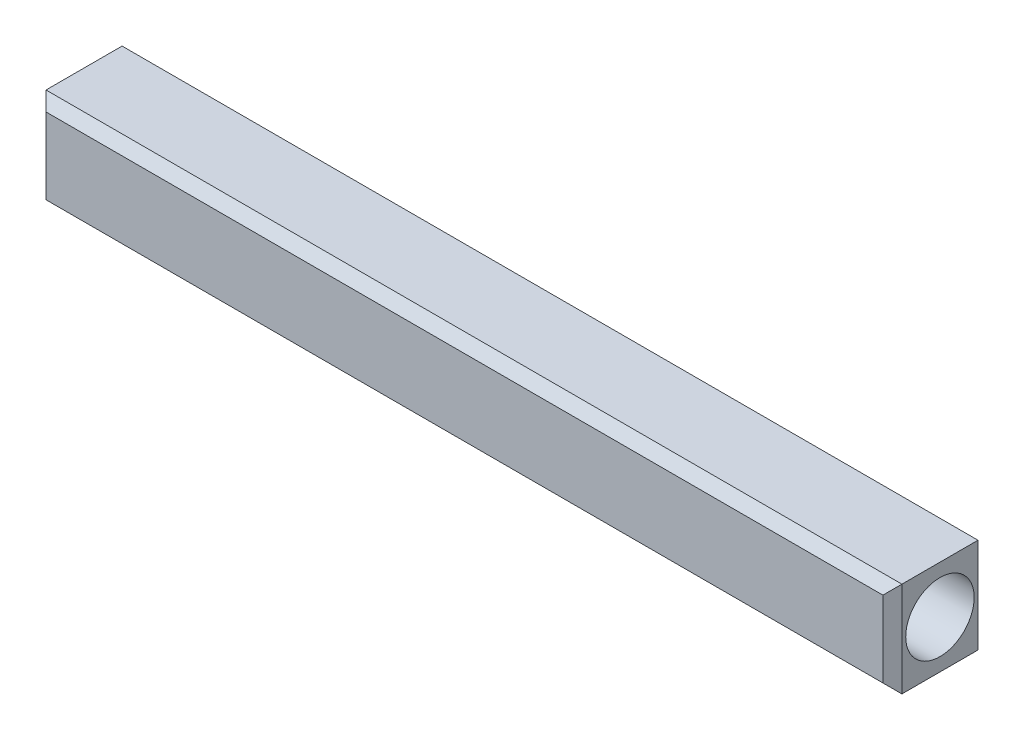
ISO-10303-21;
HEADER;
FILE_DESCRIPTION(('STEP AP214'),'2;1');
FILE_NAME('part.step','',(''),(''),'','','');
FILE_SCHEMA(('AUTOMOTIVE_DESIGN { 1 0 10303 214 1 1 1 1 }'));
ENDSEC;
DATA;
#1=APPLICATION_CONTEXT('core data for automotive mechanical design processes');
#2=APPLICATION_PROTOCOL_DEFINITION('international standard','automotive_design',2000,#1);
#3=PRODUCT_CONTEXT('',#1,'mechanical');
#4=PRODUCT('Part','Part','',(#3));
#5=PRODUCT_RELATED_PRODUCT_CATEGORY('part','',(#4));
#6=PRODUCT_DEFINITION_FORMATION('','',#4);
#7=PRODUCT_DEFINITION_CONTEXT('part definition',#1,'design');
#8=PRODUCT_DEFINITION('design','',#6,#7);
#9=PRODUCT_DEFINITION_SHAPE('','',#8);
#10=(LENGTH_UNIT() NAMED_UNIT(*) SI_UNIT(.MILLI.,.METRE.));
#11=(NAMED_UNIT(*) PLANE_ANGLE_UNIT() SI_UNIT($,.RADIAN.));
#12=(NAMED_UNIT(*) SI_UNIT($,.STERADIAN.) SOLID_ANGLE_UNIT());
#13=UNCERTAINTY_MEASURE_WITH_UNIT(LENGTH_MEASURE(1.E-05),#10,'distance_accuracy_value','');
#14=(GEOMETRIC_REPRESENTATION_CONTEXT(3) GLOBAL_UNCERTAINTY_ASSIGNED_CONTEXT((#13)) GLOBAL_UNIT_ASSIGNED_CONTEXT((#10,
#11,#12)) REPRESENTATION_CONTEXT('',''));
#15=CARTESIAN_POINT('',(0.,0.,0.));
#16=DIRECTION('',(0.,0.,1.));
#17=DIRECTION('',(1.,0.,0.));
#18=AXIS2_PLACEMENT_3D('',#15,#16,#17);
#19=CARTESIAN_POINT('',(22.5,5.,5.));
#20=DIRECTION('',(1.,0.,0.));
#21=DIRECTION('',(0.,0.,-1.));
#22=AXIS2_PLACEMENT_3D('',#19,#20,#21);
#23=PLANE('',#22);
#24=DIRECTION('',(0.,0.,-1.));
#25=VECTOR('',#24,1.);
#26=CARTESIAN_POINT('',(22.5,0.,5.));
#27=LINE('',#26,#25);
#28=CARTESIAN_POINT('',(22.5,0.,4.5));
#29=VERTEX_POINT('',#28);
#30=CARTESIAN_POINT('',(22.5,0.,0.5));
#31=VERTEX_POINT('',#30);
#32=EDGE_CURVE('E174',#29,#31,#27,.T.);
#33=ORIENTED_EDGE('',*,*,#32,.T.);
#34=DIRECTION('',(0.,1.,0.));
#35=VECTOR('',#34,1.);
#36=CARTESIAN_POINT('',(22.5,5.,0.5));
#37=LINE('',#36,#35);
#38=CARTESIAN_POINT('',(22.5,5.,0.5));
#39=VERTEX_POINT('',#38);
#40=EDGE_CURVE('E105',#31,#39,#37,.T.);
#41=ORIENTED_EDGE('',*,*,#40,.T.);
#42=DIRECTION('',(0.,0.,-1.));
#43=VECTOR('',#42,1.);
#44=CARTESIAN_POINT('',(22.5,5.,5.));
#45=LINE('',#44,#43);
#46=CARTESIAN_POINT('',(22.5,5.,4.5));
#47=VERTEX_POINT('',#46);
#48=EDGE_CURVE('E176',#47,#39,#45,.T.);
#49=ORIENTED_EDGE('',*,*,#48,.F.);
#50=DIRECTION('',(0.,-1.,0.));
#51=VECTOR('',#50,1.);
#52=CARTESIAN_POINT('',(22.5,5.,4.5));
#53=LINE('',#52,#51);
#54=EDGE_CURVE('E124',#47,#29,#53,.T.);
#55=ORIENTED_EDGE('',*,*,#54,.T.);
#56=EDGE_LOOP('',(#33,#41,#49,#55));
#57=FACE_BOUND('',#56,.T.);
#58=CARTESIAN_POINT('',(22.5,2.5,2.5));
#59=DIRECTION('',(-1.,0.,0.));
#60=DIRECTION('',(0.,0.,1.));
#61=AXIS2_PLACEMENT_3D('',#58,#59,#60);
#62=CIRCLE('',#61,1.8);
#63=CARTESIAN_POINT('',(22.5,2.5,4.3));
#64=VERTEX_POINT('',#63);
#65=EDGE_CURVE('E153',#64,#64,#62,.T.);
#66=ORIENTED_EDGE('',*,*,#65,.T.);
#67=EDGE_LOOP('',(#66));
#68=FACE_BOUND('',#67,.T.);
#69=ADVANCED_FACE('F33',(#57,#68),#23,.T.);
#70=CARTESIAN_POINT('',(-22.5,0.,5.));
#71=DIRECTION('',(0.,1.,0.));
#72=DIRECTION('',(-1.,0.,0.));
#73=AXIS2_PLACEMENT_3D('',#70,#71,#72);
#74=PLANE('',#73);
#75=DIRECTION('',(0.,0.,-1.));
#76=VECTOR('',#75,1.);
#77=CARTESIAN_POINT('',(-22.5,0.,5.));
#78=LINE('',#77,#76);
#79=CARTESIAN_POINT('',(-22.5,0.,4.5));
#80=VERTEX_POINT('',#79);
#81=CARTESIAN_POINT('',(-22.5,0.,0.5));
#82=VERTEX_POINT('',#81);
#83=EDGE_CURVE('E191',#80,#82,#78,.T.);
#84=ORIENTED_EDGE('',*,*,#83,.T.);
#85=DIRECTION('',(1.,0.,0.));
#86=VECTOR('',#85,1.);
#87=CARTESIAN_POINT('',(-22.5,0.,0.5));
#88=LINE('',#87,#86);
#89=EDGE_CURVE('E142',#82,#31,#88,.T.);
#90=ORIENTED_EDGE('',*,*,#89,.T.);
#91=ORIENTED_EDGE('',*,*,#32,.F.);
#92=DIRECTION('',(-1.,0.,0.));
#93=VECTOR('',#92,1.);
#94=CARTESIAN_POINT('',(-22.5,0.,4.5));
#95=LINE('',#94,#93);
#96=EDGE_CURVE('E140',#29,#80,#95,.T.);
#97=ORIENTED_EDGE('',*,*,#96,.T.);
#98=EDGE_LOOP('',(#84,#90,#91,#97));
#99=FACE_BOUND('',#98,.T.);
#100=ADVANCED_FACE('F179',(#99),#74,.F.);
#101=CARTESIAN_POINT('',(-22.5,5.,5.));
#102=DIRECTION('',(0.,-1.,0.));
#103=DIRECTION('',(0.,0.,-1.));
#104=AXIS2_PLACEMENT_3D('',#101,#102,#103);
#105=PLANE('',#104);
#106=ORIENTED_EDGE('',*,*,#48,.T.);
#107=DIRECTION('',(-1.,0.,0.));
#108=VECTOR('',#107,1.);
#109=CARTESIAN_POINT('',(-22.5,5.,0.5));
#110=LINE('',#109,#108);
#111=CARTESIAN_POINT('',(-22.5,5.,0.5));
#112=VERTEX_POINT('',#111);
#113=EDGE_CURVE('E133',#39,#112,#110,.T.);
#114=ORIENTED_EDGE('',*,*,#113,.T.);
#115=DIRECTION('',(0.,0.,-1.));
#116=VECTOR('',#115,1.);
#117=CARTESIAN_POINT('',(-22.5,5.,5.));
#118=LINE('',#117,#116);
#119=CARTESIAN_POINT('',(-22.5,5.,4.5));
#120=VERTEX_POINT('',#119);
#121=EDGE_CURVE('E118',#120,#112,#118,.T.);
#122=ORIENTED_EDGE('',*,*,#121,.F.);
#123=DIRECTION('',(1.,0.,0.));
#124=VECTOR('',#123,1.);
#125=CARTESIAN_POINT('',(22.5,5.,4.5));
#126=LINE('',#125,#124);
#127=EDGE_CURVE('E131',#120,#47,#126,.T.);
#128=ORIENTED_EDGE('',*,*,#127,.T.);
#129=EDGE_LOOP('',(#106,#114,#122,#128));
#130=FACE_BOUND('',#129,.T.);
#131=ADVANCED_FACE('F204',(#130),#105,.F.);
#132=CARTESIAN_POINT('',(-22.5,5.,5.));
#133=DIRECTION('',(1.,0.,0.));
#134=DIRECTION('',(0.,0.,-1.));
#135=AXIS2_PLACEMENT_3D('',#132,#133,#134);
#136=PLANE('',#135);
#137=CARTESIAN_POINT('',(-22.5,2.5,2.5));
#138=DIRECTION('',(-1.,0.,0.));
#139=DIRECTION('',(0.,0.,1.));
#140=AXIS2_PLACEMENT_3D('',#137,#138,#139);
#141=CIRCLE('',#140,1.8);
#142=CARTESIAN_POINT('',(-22.5,2.5,4.3));
#143=VERTEX_POINT('',#142);
#144=EDGE_CURVE('E181',#143,#143,#141,.T.);
#145=ORIENTED_EDGE('',*,*,#144,.F.);
#146=EDGE_LOOP('',(#145));
#147=FACE_BOUND('',#146,.T.);
#148=ORIENTED_EDGE('',*,*,#121,.T.);
#149=DIRECTION('',(0.,-1.,0.));
#150=VECTOR('',#149,1.);
#151=CARTESIAN_POINT('',(-22.5,5.,0.5));
#152=LINE('',#151,#150);
#153=EDGE_CURVE('E138',#112,#82,#152,.T.);
#154=ORIENTED_EDGE('',*,*,#153,.T.);
#155=ORIENTED_EDGE('',*,*,#83,.F.);
#156=DIRECTION('',(0.,1.,0.));
#157=VECTOR('',#156,1.);
#158=CARTESIAN_POINT('',(-22.5,5.,4.5));
#159=LINE('',#158,#157);
#160=EDGE_CURVE('E135',#80,#120,#159,.T.);
#161=ORIENTED_EDGE('',*,*,#160,.T.);
#162=EDGE_LOOP('',(#148,#154,#155,#161));
#163=FACE_BOUND('',#162,.T.);
#164=ADVANCED_FACE('F206',(#147,#163),#136,.F.);
#165=CARTESIAN_POINT('',(0.,0.,5.));
#166=DIRECTION('',(0.,0.,1.));
#167=DIRECTION('',(1.,0.,0.));
#168=AXIS2_PLACEMENT_3D('',#165,#166,#167);
#169=PLANE('',#168);
#170=DIRECTION('',(-1.,0.,0.));
#171=VECTOR('',#170,1.);
#172=CARTESIAN_POINT('',(-22.5,4.5,5.));
#173=LINE('',#172,#171);
#174=CARTESIAN_POINT('',(22.,4.5,5.));
#175=VERTEX_POINT('',#174);
#176=CARTESIAN_POINT('',(-22.,4.5,5.));
#177=VERTEX_POINT('',#176);
#178=EDGE_CURVE('E42',#175,#177,#173,.T.);
#179=ORIENTED_EDGE('',*,*,#178,.T.);
#180=DIRECTION('',(0.,-1.,0.));
#181=VECTOR('',#180,1.);
#182=CARTESIAN_POINT('',(-22.,0.,5.));
#183=LINE('',#182,#181);
#184=CARTESIAN_POINT('',(-22.,0.500000000000001,5.));
#185=VERTEX_POINT('',#184);
#186=EDGE_CURVE('E11',#177,#185,#183,.T.);
#187=ORIENTED_EDGE('',*,*,#186,.T.);
#188=DIRECTION('',(1.,0.,0.));
#189=VECTOR('',#188,1.);
#190=CARTESIAN_POINT('',(22.5,0.5,5.));
#191=LINE('',#190,#189);
#192=CARTESIAN_POINT('',(22.,0.5,5.));
#193=VERTEX_POINT('',#192);
#194=EDGE_CURVE('E144',#185,#193,#191,.T.);
#195=ORIENTED_EDGE('',*,*,#194,.T.);
#196=DIRECTION('',(0.,1.,0.));
#197=VECTOR('',#196,1.);
#198=CARTESIAN_POINT('',(22.,0.,5.));
#199=LINE('',#198,#197);
#200=EDGE_CURVE('E53',#193,#175,#199,.T.);
#201=ORIENTED_EDGE('',*,*,#200,.T.);
#202=EDGE_LOOP('',(#179,#187,#195,#201));
#203=FACE_BOUND('',#202,.T.);
#204=ADVANCED_FACE('F213',(#203),#169,.T.);
#205=CARTESIAN_POINT('',(0.,0.,0.));
#206=DIRECTION('',(0.,0.,1.));
#207=DIRECTION('',(1.,0.,0.));
#208=AXIS2_PLACEMENT_3D('',#205,#206,#207);
#209=PLANE('',#208);
#210=DIRECTION('',(1.,0.,0.));
#211=VECTOR('',#210,1.);
#212=CARTESIAN_POINT('',(0.,4.5,0.));
#213=LINE('',#212,#211);
#214=CARTESIAN_POINT('',(-22.,4.5,0.));
#215=VERTEX_POINT('',#214);
#216=CARTESIAN_POINT('',(22.,4.5,0.));
#217=VERTEX_POINT('',#216);
#218=EDGE_CURVE('E122',#215,#217,#213,.T.);
#219=ORIENTED_EDGE('',*,*,#218,.T.);
#220=DIRECTION('',(0.,-1.,0.));
#221=VECTOR('',#220,1.);
#222=CARTESIAN_POINT('',(22.,0.,0.));
#223=LINE('',#222,#221);
#224=CARTESIAN_POINT('',(22.,0.5,0.));
#225=VERTEX_POINT('',#224);
#226=EDGE_CURVE('E103',#217,#225,#223,.T.);
#227=ORIENTED_EDGE('',*,*,#226,.T.);
#228=DIRECTION('',(-1.,0.,0.));
#229=VECTOR('',#228,1.);
#230=CARTESIAN_POINT('',(0.,0.5,0.));
#231=LINE('',#230,#229);
#232=CARTESIAN_POINT('',(-22.,0.500000000000001,0.));
#233=VERTEX_POINT('',#232);
#234=EDGE_CURVE('E111',#225,#233,#231,.T.);
#235=ORIENTED_EDGE('',*,*,#234,.T.);
#236=DIRECTION('',(0.,1.,0.));
#237=VECTOR('',#236,1.);
#238=CARTESIAN_POINT('',(-22.,0.,0.));
#239=LINE('',#238,#237);
#240=EDGE_CURVE('E117',#233,#215,#239,.T.);
#241=ORIENTED_EDGE('',*,*,#240,.T.);
#242=EDGE_LOOP('',(#219,#227,#235,#241));
#243=FACE_BOUND('',#242,.T.);
#244=ADVANCED_FACE('F120',(#243),#209,.F.);
#245=CARTESIAN_POINT('',(-17.5,2.5,2.5));
#246=DIRECTION('',(-1.,0.,0.));
#247=DIRECTION('',(0.,0.,1.));
#248=AXIS2_PLACEMENT_3D('',#245,#246,#247);
#249=CYLINDRICAL_SURFACE('',#248,1.8);
#250=CARTESIAN_POINT('',(-17.5,2.5,2.5));
#251=DIRECTION('',(-1.,0.,0.));
#252=DIRECTION('',(0.,0.,1.));
#253=AXIS2_PLACEMENT_3D('',#250,#251,#252);
#254=CIRCLE('',#253,1.8);
#255=CARTESIAN_POINT('',(-17.5,2.5,4.3));
#256=VERTEX_POINT('',#255);
#257=EDGE_CURVE('E184',#256,#256,#254,.T.);
#258=ORIENTED_EDGE('',*,*,#257,.F.);
#259=EDGE_LOOP('',(#258));
#260=FACE_BOUND('',#259,.T.);
#261=ORIENTED_EDGE('',*,*,#144,.T.);
#262=EDGE_LOOP('',(#261));
#263=FACE_BOUND('',#262,.T.);
#264=ADVANCED_FACE('F220',(#260,#263),#249,.F.);
#265=CARTESIAN_POINT('',(-17.5,2.5,2.5));
#266=DIRECTION('',(-1.,0.,0.));
#267=DIRECTION('',(0.,0.,1.));
#268=AXIS2_PLACEMENT_3D('',#265,#266,#267);
#269=PLANE('',#268);
#270=ORIENTED_EDGE('',*,*,#257,.T.);
#271=EDGE_LOOP('',(#270));
#272=FACE_BOUND('',#271,.T.);
#273=ADVANCED_FACE('F235',(#272),#269,.T.);
#274=CARTESIAN_POINT('',(17.5,2.5,2.5));
#275=DIRECTION('',(1.,0.,0.));
#276=DIRECTION('',(0.,0.,-1.));
#277=AXIS2_PLACEMENT_3D('',#274,#275,#276);
#278=CYLINDRICAL_SURFACE('',#277,1.8);
#279=CARTESIAN_POINT('',(17.5,2.5,2.5));
#280=DIRECTION('',(-1.,0.,0.));
#281=DIRECTION('',(0.,0.,1.));
#282=AXIS2_PLACEMENT_3D('',#279,#280,#281);
#283=CIRCLE('',#282,1.8);
#284=CARTESIAN_POINT('',(17.5,2.5,4.3));
#285=VERTEX_POINT('',#284);
#286=EDGE_CURVE('E186',#285,#285,#283,.T.);
#287=ORIENTED_EDGE('',*,*,#286,.T.);
#288=EDGE_LOOP('',(#287));
#289=FACE_BOUND('',#288,.T.);
#290=ORIENTED_EDGE('',*,*,#65,.F.);
#291=EDGE_LOOP('',(#290));
#292=FACE_BOUND('',#291,.T.);
#293=ADVANCED_FACE('F233',(#289,#292),#278,.F.);
#294=CARTESIAN_POINT('',(17.5,2.5,2.5));
#295=DIRECTION('',(1.,0.,0.));
#296=DIRECTION('',(0.,0.,1.));
#297=AXIS2_PLACEMENT_3D('',#294,#295,#296);
#298=PLANE('',#297);
#299=ORIENTED_EDGE('',*,*,#286,.F.);
#300=EDGE_LOOP('',(#299));
#301=FACE_BOUND('',#300,.T.);
#302=ADVANCED_FACE('F257',(#301),#298,.T.);
#303=CARTESIAN_POINT('',(-22.5,5.,0.5));
#304=DIRECTION('',(0.707106781186547,0.,0.707106781186547));
#305=DIRECTION('',(0.,-1.,0.));
#306=AXIS2_PLACEMENT_3D('',#303,#304,#305);
#307=PLANE('',#306);
#308=DIRECTION('',(0.577350269189626,0.577350269189626,-0.577350269189626));
#309=VECTOR('',#308,1.);
#310=CARTESIAN_POINT('',(-22.5,0.,0.5));
#311=LINE('',#310,#309);
#312=EDGE_CURVE('E114',#82,#233,#311,.T.);
#313=ORIENTED_EDGE('',*,*,#312,.F.);
#314=ORIENTED_EDGE('',*,*,#153,.F.);
#315=DIRECTION('',(0.577350269189626,-0.577350269189626,-0.577350269189626));
#316=VECTOR('',#315,1.);
#317=CARTESIAN_POINT('',(-22.5,5.,0.5));
#318=LINE('',#317,#316);
#319=EDGE_CURVE('E150',#215,#112,#318,.F.);
#320=ORIENTED_EDGE('',*,*,#319,.F.);
#321=ORIENTED_EDGE('',*,*,#240,.F.);
#322=EDGE_LOOP('',(#313,#314,#320,#321));
#323=FACE_BOUND('',#322,.T.);
#324=ADVANCED_FACE('F198',(#323),#307,.F.);
#325=CARTESIAN_POINT('',(-22.5,5.,0.5));
#326=DIRECTION('',(0.,-0.707106781186547,0.707106781186547));
#327=DIRECTION('',(-1.,0.,0.));
#328=AXIS2_PLACEMENT_3D('',#325,#326,#327);
#329=PLANE('',#328);
#330=ORIENTED_EDGE('',*,*,#319,.T.);
#331=ORIENTED_EDGE('',*,*,#113,.F.);
#332=DIRECTION('',(0.577350269189626,0.577350269189626,0.577350269189626));
#333=VECTOR('',#332,1.);
#334=CARTESIAN_POINT('',(7.5,-10.,-14.5));
#335=LINE('',#334,#333);
#336=EDGE_CURVE('E108',#217,#39,#335,.T.);
#337=ORIENTED_EDGE('',*,*,#336,.F.);
#338=ORIENTED_EDGE('',*,*,#218,.F.);
#339=EDGE_LOOP('',(#330,#331,#337,#338));
#340=FACE_BOUND('',#339,.T.);
#341=ADVANCED_FACE('F201',(#340),#329,.F.);
#342=CARTESIAN_POINT('',(-22.5,0.,0.5));
#343=DIRECTION('',(0.,0.707106781186547,0.707106781186547));
#344=DIRECTION('',(1.,0.,0.));
#345=AXIS2_PLACEMENT_3D('',#342,#343,#344);
#346=PLANE('',#345);
#347=ORIENTED_EDGE('',*,*,#312,.T.);
#348=ORIENTED_EDGE('',*,*,#234,.F.);
#349=DIRECTION('',(-0.577350269189626,0.577350269189626,-0.577350269189626));
#350=VECTOR('',#349,1.);
#351=CARTESIAN_POINT('',(7.5,15.,-14.5));
#352=LINE('',#351,#350);
#353=EDGE_CURVE('E99',#31,#225,#352,.T.);
#354=ORIENTED_EDGE('',*,*,#353,.F.);
#355=ORIENTED_EDGE('',*,*,#89,.F.);
#356=EDGE_LOOP('',(#347,#348,#354,#355));
#357=FACE_BOUND('',#356,.T.);
#358=ADVANCED_FACE('F112',(#357),#346,.F.);
#359=CARTESIAN_POINT('',(22.,0.,0.));
#360=DIRECTION('',(0.707106781186547,0.,-0.707106781186547));
#361=DIRECTION('',(0.,1.,0.));
#362=AXIS2_PLACEMENT_3D('',#359,#360,#361);
#363=PLANE('',#362);
#364=ORIENTED_EDGE('',*,*,#336,.T.);
#365=ORIENTED_EDGE('',*,*,#40,.F.);
#366=ORIENTED_EDGE('',*,*,#353,.T.);
#367=ORIENTED_EDGE('',*,*,#226,.F.);
#368=EDGE_LOOP('',(#364,#365,#366,#367));
#369=FACE_BOUND('',#368,.T.);
#370=ADVANCED_FACE('F101',(#369),#363,.T.);
#371=CARTESIAN_POINT('',(22.5,5.,4.5));
#372=DIRECTION('',(-0.707106781186547,0.,-0.707106781186547));
#373=DIRECTION('',(0.,-1.,0.));
#374=AXIS2_PLACEMENT_3D('',#371,#372,#373);
#375=PLANE('',#374);
#376=DIRECTION('',(0.577350269189626,-0.577350269189626,-0.577350269189626));
#377=VECTOR('',#376,1.);
#378=CARTESIAN_POINT('',(14.6666666666667,7.83333333333333,12.3333333333333));
#379=LINE('',#378,#377);
#380=EDGE_CURVE('E157',#29,#193,#379,.F.);
#381=ORIENTED_EDGE('',*,*,#380,.F.);
#382=ORIENTED_EDGE('',*,*,#54,.F.);
#383=DIRECTION('',(0.577350269189626,0.577350269189626,-0.577350269189626));
#384=VECTOR('',#383,1.);
#385=CARTESIAN_POINT('',(22.5,5.,4.5));
#386=LINE('',#385,#384);
#387=EDGE_CURVE('E37',#175,#47,#386,.T.);
#388=ORIENTED_EDGE('',*,*,#387,.F.);
#389=ORIENTED_EDGE('',*,*,#200,.F.);
#390=EDGE_LOOP('',(#381,#382,#388,#389));
#391=FACE_BOUND('',#390,.T.);
#392=ADVANCED_FACE('F35',(#391),#375,.F.);
#393=CARTESIAN_POINT('',(0.,4.5,5.));
#394=DIRECTION('',(0.,0.707106781186547,0.707106781186547));
#395=DIRECTION('',(1.,0.,0.));
#396=AXIS2_PLACEMENT_3D('',#393,#394,#395);
#397=PLANE('',#396);
#398=ORIENTED_EDGE('',*,*,#387,.T.);
#399=ORIENTED_EDGE('',*,*,#127,.F.);
#400=DIRECTION('',(0.577350269189626,-0.577350269189626,0.577350269189626));
#401=VECTOR('',#400,1.);
#402=CARTESIAN_POINT('',(-14.6666666666667,-2.83333333333333,12.3333333333333));
#403=LINE('',#402,#401);
#404=EDGE_CURVE('E156',#177,#120,#403,.F.);
#405=ORIENTED_EDGE('',*,*,#404,.F.);
#406=ORIENTED_EDGE('',*,*,#178,.F.);
#407=EDGE_LOOP('',(#398,#399,#405,#406));
#408=FACE_BOUND('',#407,.T.);
#409=ADVANCED_FACE('F166',(#408),#397,.T.);
#410=CARTESIAN_POINT('',(0.,0.5,5.));
#411=DIRECTION('',(0.,-0.707106781186547,0.707106781186547));
#412=DIRECTION('',(-1.,0.,0.));
#413=AXIS2_PLACEMENT_3D('',#410,#411,#412);
#414=PLANE('',#413);
#415=ORIENTED_EDGE('',*,*,#380,.T.);
#416=ORIENTED_EDGE('',*,*,#194,.F.);
#417=DIRECTION('',(-0.577350269189626,-0.577350269189626,-0.577350269189626));
#418=VECTOR('',#417,1.);
#419=CARTESIAN_POINT('',(-14.6666666666667,7.83333333333333,12.3333333333333));
#420=LINE('',#419,#418);
#421=EDGE_CURVE('E154',#80,#185,#420,.F.);
#422=ORIENTED_EDGE('',*,*,#421,.F.);
#423=ORIENTED_EDGE('',*,*,#96,.F.);
#424=EDGE_LOOP('',(#415,#416,#422,#423));
#425=FACE_BOUND('',#424,.T.);
#426=ADVANCED_FACE('F212',(#425),#414,.T.);
#427=CARTESIAN_POINT('',(-22.,0.,5.));
#428=DIRECTION('',(-0.707106781186547,0.,0.707106781186547));
#429=DIRECTION('',(0.,1.,0.));
#430=AXIS2_PLACEMENT_3D('',#427,#428,#429);
#431=PLANE('',#430);
#432=ORIENTED_EDGE('',*,*,#404,.T.);
#433=ORIENTED_EDGE('',*,*,#160,.F.);
#434=ORIENTED_EDGE('',*,*,#421,.T.);
#435=ORIENTED_EDGE('',*,*,#186,.F.);
#436=EDGE_LOOP('',(#432,#433,#434,#435));
#437=FACE_BOUND('',#436,.T.);
#438=ADVANCED_FACE('F210',(#437),#431,.T.);
#439=CLOSED_SHELL('',(#69,#100,#131,#164,#204,#244,#264,#273,#293,#302,#324,#341,#358,#370,#392,
#409,#426,#438));
#440=MANIFOLD_SOLID_BREP('B2',#439);
#441=ADVANCED_BREP_SHAPE_REPRESENTATION('',(#18,#440),#14);
#442=SHAPE_DEFINITION_REPRESENTATION(#9,#441);
ENDSEC;
END-ISO-10303-21;
